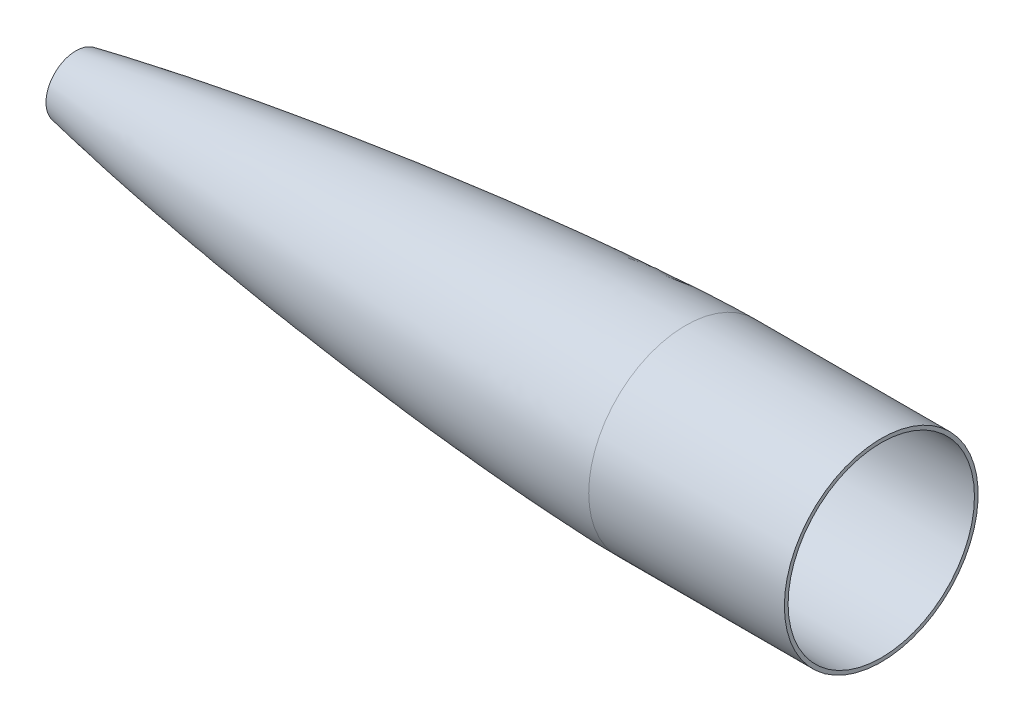
ISO-10303-21;
HEADER;
FILE_DESCRIPTION(('STEP AP214'),'2;1');
FILE_NAME('part.step','',(''),(''),'','','');
FILE_SCHEMA(('AUTOMOTIVE_DESIGN { 1 0 10303 214 1 1 1 1 }'));
ENDSEC;
DATA;
#1=APPLICATION_CONTEXT('core data for automotive mechanical design processes');
#2=APPLICATION_PROTOCOL_DEFINITION('international standard','automotive_design',2000,#1);
#3=PRODUCT_CONTEXT('',#1,'mechanical');
#4=PRODUCT('Part','Part','',(#3));
#5=PRODUCT_RELATED_PRODUCT_CATEGORY('part','',(#4));
#6=PRODUCT_DEFINITION_FORMATION('','',#4);
#7=PRODUCT_DEFINITION_CONTEXT('part definition',#1,'design');
#8=PRODUCT_DEFINITION('design','',#6,#7);
#9=PRODUCT_DEFINITION_SHAPE('','',#8);
#10=(LENGTH_UNIT() NAMED_UNIT(*) SI_UNIT(.MILLI.,.METRE.));
#11=(NAMED_UNIT(*) PLANE_ANGLE_UNIT() SI_UNIT($,.RADIAN.));
#12=(NAMED_UNIT(*) SI_UNIT($,.STERADIAN.) SOLID_ANGLE_UNIT());
#13=UNCERTAINTY_MEASURE_WITH_UNIT(LENGTH_MEASURE(1.E-05),#10,'distance_accuracy_value','');
#14=(GEOMETRIC_REPRESENTATION_CONTEXT(3) GLOBAL_UNCERTAINTY_ASSIGNED_CONTEXT((#13)) GLOBAL_UNIT_ASSIGNED_CONTEXT((#10,
#11,#12)) REPRESENTATION_CONTEXT('',''));
#15=CARTESIAN_POINT('',(0.,0.,0.));
#16=DIRECTION('',(0.,0.,1.));
#17=DIRECTION('',(1.,0.,0.));
#18=AXIS2_PLACEMENT_3D('',#15,#16,#17);
#19=CARTESIAN_POINT('',(-19.05,0.,0.));
#20=DIRECTION('',(-1.,0.,0.));
#21=DIRECTION('',(0.,0.,1.));
#22=AXIS2_PLACEMENT_3D('',#19,#20,#21);
#23=CYLINDRICAL_SURFACE('',#22,39.7256);
#24=CARTESIAN_POINT('',(294.4368,0.,0.));
#25=DIRECTION('',(-1.,0.,0.));
#26=DIRECTION('',(0.,0.,1.));
#27=AXIS2_PLACEMENT_3D('',#24,#25,#26);
#28=CIRCLE('',#27,39.7256);
#29=CARTESIAN_POINT('',(294.4368,0.,39.7256));
#30=VERTEX_POINT('',#29);
#31=EDGE_CURVE('E10',#30,#30,#28,.T.);
#32=ORIENTED_EDGE('',*,*,#31,.F.);
#33=EDGE_LOOP('',(#32));
#34=FACE_BOUND('',#33,.T.);
#35=CARTESIAN_POINT('',(374.650064344496,0.,0.));
#36=DIRECTION('',(-1.,0.,0.));
#37=DIRECTION('',(0.,0.,1.));
#38=AXIS2_PLACEMENT_3D('',#35,#36,#37);
#39=CIRCLE('',#38,39.7256);
#40=CARTESIAN_POINT('',(374.650064344496,0.,39.7256));
#41=VERTEX_POINT('',#40);
#42=EDGE_CURVE('E37',#41,#41,#39,.T.);
#43=ORIENTED_EDGE('',*,*,#42,.T.);
#44=EDGE_LOOP('',(#43));
#45=FACE_BOUND('',#44,.T.);
#46=ADVANCED_FACE('F30',(#34,#45),#23,.T.);
#47=CARTESIAN_POINT('',(294.4368,39.7256,0.));
#48=CARTESIAN_POINT('',(293.538264936894,39.7227781703544,0.));
#49=CARTESIAN_POINT('',(291.741303803302,39.7002039400171,0.));
#50=CARTESIAN_POINT('',(288.147806256193,39.6307016879067,0.));
#51=CARTESIAN_POINT('',(279.918815613173,39.3889822589623,0.));
#52=CARTESIAN_POINT('',(267.957235485054,38.8762226570791,0.));
#53=CARTESIAN_POINT('',(252.269921818901,37.9897310289716,0.));
#54=CARTESIAN_POINT('',(233.761451080803,36.6987300745286,0.));
#55=CARTESIAN_POINT('',(215.268686952188,35.200969595861,0.));
#56=CARTESIAN_POINT('',(196.792047007808,33.5162401971686,0.));
#57=CARTESIAN_POINT('',(178.332324198228,31.6557055301637,0.));
#58=CARTESIAN_POINT('',(159.890639304378,29.6240021598707,0.));
#59=CARTESIAN_POINT('',(141.468704528161,27.4205610926059,0.));
#60=CARTESIAN_POINT('',(123.068739671915,25.0400732746453,0.));
#61=CARTESIAN_POINT('',(104.694212708318,22.4706963349108,0.));
#62=CARTESIAN_POINT('',(86.3496826980187,19.6939502091708,0.));
#63=CARTESIAN_POINT('',(68.0430622365847,16.6772648540575,0.));
#64=CARTESIAN_POINT('',(49.818424698582,13.3765223021058,0.));
#65=CARTESIAN_POINT('',(33.9406856398122,10.1498634465492,0.));
#66=CARTESIAN_POINT('',(21.1447927754208,7.19091792425048,0.));
#67=CARTESIAN_POINT('',(12.0854389700209,4.74376046507185,0.));
#68=CARTESIAN_POINT('',(7.05576322628537,3.17959978307188,0.));
#69=CARTESIAN_POINT('',(4.0188012304067,2.08676764385367,0.));
#70=CARTESIAN_POINT('',(2.33371074508546,1.38731323839093,0.));
#71=CARTESIAN_POINT('',(1.40388432372297,0.947026682290267,0.));
#72=CARTESIAN_POINT('',(0.87209723308368,0.661946371557733,0.));
#73=CARTESIAN_POINT('',(0.556889445492457,0.472533954344698,0.));
#74=CARTESIAN_POINT('',(0.370605462423568,0.347964982562249,0.));
#75=CARTESIAN_POINT('',(0.248450567810074,0.257670761882754,0.));
#76=CARTESIAN_POINT('',(0.159992101765354,0.185526094257961,0.));
#77=CARTESIAN_POINT('',(0.0986367195289148,0.129934350685668,0.));
#78=CARTESIAN_POINT('',(0.0520006916757201,0.0813137653612726,0.));
#79=CARTESIAN_POINT('',(0.0201829235935841,0.0404052506099982,0.));
#80=CARTESIAN_POINT('',(0.00657570245071043,0.0182498433560136,0.));
#81=CARTESIAN_POINT('',(0.00185773297492475,0.0062340322543729,0.));
#82=CARTESIAN_POINT('',(0.,0.,0.));
#83=B_SPLINE_CURVE_WITH_KNOTS('',4,(#47,#48,#49,#50,#51,#52,#53,#54,#55,#56,#57,#58,#59,#60,#61,
#62,#63,#64,#65,#66,#67,#68,#69,#70,#71,#72,#73,#74,#75,#76,#77,#78,#79,#80,#81,#82),
.UNSPECIFIED.,.F.,.F.,(5,1,1,1,1,1,1,1,1,1,1,1,1,1,1,1,1,1,1,1,1,1,1,1,1,1,1,1,1,1,1,1,5),(0.,
0.0120599701125952,0.0241199402251903,0.0482398804503805,0.1104935820596,0.172747283844769,
0.235000984013769,0.297254686823773,0.359508386221387,0.421762088339113,0.484015788959948,
0.546269489090148,0.60852319021114,0.670776891466794,0.733030591698496,0.795284289783134,
0.857537990172938,0.919348906793277,0.95047573101264,0.971525230460581,0.983463902787434,
0.99002606304966,0.993781479893161,0.996003962640871,0.997267165840399,0.998121150964244,
0.998715599634537,0.999010469110389,0.999305338586241,0.99965266929312,0.99982633464656,
0.99991316732328,1.),.UNSPECIFIED.);
#84=CARTESIAN_POINT('',(-19.05,0.,0.));
#85=DIRECTION('',(-1.,0.,0.));
#86=AXIS1_PLACEMENT('',#84,#85);
#87=SURFACE_OF_REVOLUTION('',#83,#86);
#88=CARTESIAN_POINT('',(44.4500643444959,0.,0.));
#89=DIRECTION('',(-1.,0.,0.));
#90=DIRECTION('',(0.,0.,1.));
#91=AXIS2_PLACEMENT_3D('',#88,#89,#90);
#92=CIRCLE('',#91,12.2403045277828);
#93=CARTESIAN_POINT('',(44.4500643444959,0.,12.2403045277828));
#94=VERTEX_POINT('',#93);
#95=EDGE_CURVE('E149',#94,#94,#92,.F.);
#96=ORIENTED_EDGE('',*,*,#95,.T.);
#97=EDGE_LOOP('',(#96));
#98=FACE_BOUND('',#97,.T.);
#99=ORIENTED_EDGE('',*,*,#31,.T.);
#100=EDGE_LOOP('',(#99));
#101=FACE_BOUND('',#100,.T.);
#102=ADVANCED_FACE('F53',(#98,#101),#87,.T.);
#103=CARTESIAN_POINT('',(374.650064344496,0.,0.));
#104=DIRECTION('',(-1.,0.,0.));
#105=DIRECTION('',(0.,0.,1.));
#106=AXIS2_PLACEMENT_3D('',#103,#104,#105);
#107=PLANE('',#106);
#108=CARTESIAN_POINT('',(374.650064344496,0.,0.));
#109=DIRECTION('',(-1.,0.,0.));
#110=DIRECTION('',(0.,0.,1.));
#111=AXIS2_PLACEMENT_3D('',#108,#109,#110);
#112=CIRCLE('',#111,38.2016);
#113=CARTESIAN_POINT('',(374.650064344496,0.,38.2016));
#114=VERTEX_POINT('',#113);
#115=EDGE_CURVE('E48',#114,#114,#112,.T.);
#116=ORIENTED_EDGE('',*,*,#115,.T.);
#117=EDGE_LOOP('',(#116));
#118=FACE_BOUND('',#117,.T.);
#119=ORIENTED_EDGE('',*,*,#42,.F.);
#120=EDGE_LOOP('',(#119));
#121=FACE_BOUND('',#120,.T.);
#122=ADVANCED_FACE('F56',(#118,#121),#107,.F.);
#123=CARTESIAN_POINT('',(-19.05,0.,0.));
#124=DIRECTION('',(-1.,0.,0.));
#125=DIRECTION('',(0.,0.,1.));
#126=AXIS2_PLACEMENT_3D('',#123,#124,#125);
#127=CYLINDRICAL_SURFACE('',#126,38.2016);
#128=CARTESIAN_POINT('',(294.441586064899,0.,38.2016075152473));
#129=CARTESIAN_POINT('',(294.441586064891,-0.625072972520353,38.2016207745964));
#130=CARTESIAN_POINT('',(294.441586064892,-1.25014481680002,38.1862664038765));
#131=CARTESIAN_POINT('',(294.441586064899,-2.49878325596288,38.1249176080443));
#132=CARTESIAN_POINT('',(294.441586064904,-3.12234985084618,38.0789231829345));
#133=CARTESIAN_POINT('',(294.441586064905,-4.36647479842312,37.9563894840658));
#134=CARTESIAN_POINT('',(294.441586064901,-4.98703315111663,37.8798502103057));
#135=CARTESIAN_POINT('',(294.441586064898,-6.22364684018645,37.6964153836531));
#136=CARTESIAN_POINT('',(294.4415860649,-6.83970217656285,37.5895198307611));
#137=CARTESIAN_POINT('',(294.441586064906,-8.06582564670876,37.3456288466498));
#138=CARTESIAN_POINT('',(294.44158606491,-8.67589378047843,37.2086334154311));
#139=CARTESIAN_POINT('',(294.441586064911,-9.88857315263689,36.9048730087374));
#140=CARTESIAN_POINT('',(294.441586064908,-10.4911843910252,36.7381080332605));
#141=CARTESIAN_POINT('',(294.441586064903,-11.6874982251756,36.3752102090804));
#142=CARTESIAN_POINT('',(294.441586064901,-12.2812008209376,36.1790773603773));
#143=CARTESIAN_POINT('',(294.44158606489,-13.4582670893082,35.7579163125127));
#144=CARTESIAN_POINT('',(294.441586064881,-14.0416307619172,35.5328881133528));
#145=CARTESIAN_POINT('',(294.441586064886,-15.1966138095815,35.0544784714208));
#146=CARTESIAN_POINT('',(294.441586064899,-15.7682331846361,34.801097028647));
#147=CARTESIAN_POINT('',(294.44158606491,-16.8983505561088,34.2665913191246));
#148=CARTESIAN_POINT('',(294.441586064906,-17.4568485525265,33.9854670523749));
#149=CARTESIAN_POINT('',(294.441586064901,-18.559377696023,33.3961529475129));
#150=CARTESIAN_POINT('',(294.4415860649,-19.1034088431036,33.0879631094038));
#151=CARTESIAN_POINT('',(294.441586064901,-20.1756936693301,32.4452603182113));
#152=CARTESIAN_POINT('',(294.441586064904,-20.7039473484756,32.1107473651272));
#153=CARTESIAN_POINT('',(294.441586064905,-21.7434046294472,31.4162042149567));
#154=CARTESIAN_POINT('',(294.441586064904,-22.2546082312729,31.0561740178697));
#155=CARTESIAN_POINT('',(294.441586064905,-23.2587338233481,30.3114637239814));
#156=CARTESIAN_POINT('',(294.441586064907,-23.7516558135973,29.9267836271797));
#157=CARTESIAN_POINT('',(294.441586064905,-24.7180306902463,29.1337002619244));
#158=CARTESIAN_POINT('',(294.441586064902,-25.1914835766467,28.7252969934715));
#159=CARTESIAN_POINT('',(294.4415860649,-26.1177796561554,27.8857511641365));
#160=CARTESIAN_POINT('',(294.441586064901,-26.5706228492631,27.4546086032536));
#161=CARTESIAN_POINT('',(294.441586064902,-27.4546086032431,26.5706228492736));
#162=CARTESIAN_POINT('',(294.441586064904,-27.885751164116,26.117779656177));
#163=CARTESIAN_POINT('',(294.4415860649,-28.725296993452,25.1914835766693));
#164=CARTESIAN_POINT('',(294.441586064895,-29.1337002619148,24.7180306902578));
#165=CARTESIAN_POINT('',(294.441586064892,-29.9267836271488,23.751655813635));
#166=CARTESIAN_POINT('',(294.441586064893,-30.3114637239217,23.2587338234251));
#167=CARTESIAN_POINT('',(294.441586064897,-31.0561740178129,22.2546082313528));
#168=CARTESIAN_POINT('',(294.441586064899,-31.4162042149278,21.7434046294877));
#169=CARTESIAN_POINT('',(294.4415860649,-32.1107473651354,20.7039473484662));
#170=CARTESIAN_POINT('',(294.441586064898,-32.4452603182303,20.1756936693111));
#171=CARTESIAN_POINT('',(294.441586064894,-33.0879631094284,19.1034088430499));
#172=CARTESIAN_POINT('',(294.44158606489,-33.3961529475315,18.5593776959436));
#173=CARTESIAN_POINT('',(294.441586064886,-33.9854670524354,17.4568485524578));
#174=CARTESIAN_POINT('',(294.441586064885,-34.2665913192357,16.8983505560781));
#175=CARTESIAN_POINT('',(294.441586064892,-34.801097028535,15.7682331846684));
#176=CARTESIAN_POINT('',(294.441586064901,-35.0544784710353,15.1966138096391));
#177=CARTESIAN_POINT('',(294.441586064902,-35.5328881136757,14.041630762011));
#178=CARTESIAN_POINT('',(294.441586064895,-35.7579163138138,13.4582670894113));
#179=CARTESIAN_POINT('',(294.441586064897,-36.1790773590613,12.281200820876));
#180=CARTESIAN_POINT('',(294.441586064906,-36.3752102041712,11.6874982249406));
#181=CARTESIAN_POINT('',(294.441586064905,-36.7381080381535,10.4911843913137));
#182=CARTESIAN_POINT('',(294.441586064894,-36.9048730270277,9.88857315362268));
#183=CARTESIAN_POINT('',(294.441586064893,-37.2086333970878,8.67589377970386));
#184=CARTESIAN_POINT('',(294.441586064902,-37.3456287782738,8.06582564347604));
#185=CARTESIAN_POINT('',(294.441586064905,-37.5895198990956,6.83970218000428));
#186=CARTESIAN_POINT('',(294.441586064899,-37.6964156387287,6.22364685275981));
#187=CARTESIAN_POINT('',(294.441586064899,-37.8798499552237,4.98703313858579));
#188=CARTESIAN_POINT('',(294.441586064905,-37.9563885320872,4.36647475165647));
#189=CARTESIAN_POINT('',(294.441586064904,-38.0789241349129,3.12234989761487));
#190=CARTESIAN_POINT('',(294.441586064896,-38.1249211608762,2.49878343050271));
#191=CARTESIAN_POINT('',(294.441586064894,-38.1862628510446,1.25014464226043));
#192=CARTESIAN_POINT('',(294.441586064899,-38.2016075152473,0.625072321130206));
#193=CARTESIAN_POINT('',(294.441586064899,-38.2016075152473,-0.625072321130239));
#194=CARTESIAN_POINT('',(294.441586064894,-38.1862628510446,-1.25014464226046));
#195=CARTESIAN_POINT('',(294.441586064896,-38.1249211608762,-2.49878343050245));
#196=CARTESIAN_POINT('',(294.441586064904,-38.0789241349129,-3.12234989761433));
#197=CARTESIAN_POINT('',(294.441586064905,-37.9563885320831,-4.36647475169881));
#198=CARTESIAN_POINT('',(294.4415860649,-37.8798499552132,-4.98703313867107));
#199=CARTESIAN_POINT('',(294.441586064899,-37.6964156387202,-6.22364685280276));
#200=CARTESIAN_POINT('',(294.441586064903,-37.5895198991017,-6.83970217996289));
#201=CARTESIAN_POINT('',(294.441586064903,-37.3456287782929,-8.06582564339056));
#202=CARTESIAN_POINT('',(294.441586064897,-37.2086333970993,-8.67589377965746));
#203=CARTESIAN_POINT('',(294.44158606489,-36.9048730270299,-9.88857315361437));
#204=CARTESIAN_POINT('',(294.441586064888,-36.738108038156,-10.4911843913049));
#205=CARTESIAN_POINT('',(294.441586064889,-36.3752102041621,-11.6874982249709));
#206=CARTESIAN_POINT('',(294.441586064893,-36.1790773590385,-12.2812008209453));
#207=CARTESIAN_POINT('',(294.441586064898,-35.7579163138017,-13.4582670894398));
#208=CARTESIAN_POINT('',(294.441586064899,-35.5328881136937,-14.0416307619617));
#209=CARTESIAN_POINT('',(294.441586064901,-35.0544784710683,-15.1966138095652));
#210=CARTESIAN_POINT('',(294.441586064904,-34.8010970285467,-15.7682331846449));
#211=CARTESIAN_POINT('',(294.441586064905,-34.2665913192104,-16.8983505561304));
#212=CARTESIAN_POINT('',(294.441586064905,-33.9854670523958,-17.4568485525361));
#213=CARTESIAN_POINT('',(294.441586064902,-33.396152947493,-18.5593776960117));
#214=CARTESIAN_POINT('',(294.4415860649,-33.0879631094083,-19.1034088430834));
#215=CARTESIAN_POINT('',(294.441586064901,-32.4452603182429,-20.1756936692901));
#216=CARTESIAN_POINT('',(294.441586064903,-32.1107473651617,-20.7039473484247));
#217=CARTESIAN_POINT('',(294.441586064905,-31.4162042149759,-21.7434046294179));
#218=CARTESIAN_POINT('',(294.441586064905,-31.0561740178686,-22.2546082312748));
#219=CARTESIAN_POINT('',(294.441586064904,-30.3114637239656,-23.258733823369));
#220=CARTESIAN_POINT('',(294.441586064903,-29.9267836271714,-23.7516558136075));
#221=CARTESIAN_POINT('',(294.441586064898,-29.1337002619148,-24.7180306902578));
#222=CARTESIAN_POINT('',(294.441586064894,-28.725296993452,-25.1914835766693));
#223=CARTESIAN_POINT('',(294.441586064896,-27.8857511641265,-26.1177796561654));
#224=CARTESIAN_POINT('',(294.441586064902,-27.4546086032647,-26.5706228492509));
#225=CARTESIAN_POINT('',(294.441586064901,-26.5706228492858,-27.454608603232));
#226=CARTESIAN_POINT('',(294.441586064895,-26.117779656167,-27.885751164126));
#227=CARTESIAN_POINT('',(294.441586064895,-25.1914835766467,-28.7252969934715));
#228=CARTESIAN_POINT('',(294.441586064902,-24.7180306902463,-29.1337002619243));
#229=CARTESIAN_POINT('',(294.441586064899,-23.7516558136248,-29.9267836271572));
#230=CARTESIAN_POINT('',(294.441586064891,-23.2587338234043,-30.311463723938));
#231=CARTESIAN_POINT('',(294.441586064889,-22.2546082313311,-31.0561740178281));
#232=CARTESIAN_POINT('',(294.441586064896,-21.7434046294767,-31.4162042149351));
#233=CARTESIAN_POINT('',(294.441586064902,-20.7039473484662,-32.1107473651354));
#234=CARTESIAN_POINT('',(294.4415860649,-20.1756936693111,-32.4452603182303));
#235=CARTESIAN_POINT('',(294.441586064892,-19.1034088430499,-33.0879631094284));
#236=CARTESIAN_POINT('',(294.441586064885,-18.5593776959436,-33.3961529475315));
#237=CARTESIAN_POINT('',(294.44158606489,-17.4568485524662,-33.9854670524309));
#238=CARTESIAN_POINT('',(294.441586064902,-16.898350556095,-34.2665913192272));
#239=CARTESIAN_POINT('',(294.441586064907,-15.7682331846845,-34.801097028528));
#240=CARTESIAN_POINT('',(294.441586064899,-15.1966138096452,-35.0544784710328));
#241=CARTESIAN_POINT('',(294.441586064901,-14.0416307620475,-35.5328881136604));
#242=CARTESIAN_POINT('',(294.441586064911,-13.4582670894892,-35.7579163137838));
#243=CARTESIAN_POINT('',(294.441586064914,-12.2812008209633,-36.1790773590324));
#244=CARTESIAN_POINT('',(294.441586064907,-11.6874982249946,-36.3752102041545));
#245=CARTESIAN_POINT('',(294.441586064904,-10.491184391304,-36.7381080381568));
#246=CARTESIAN_POINT('',(294.441586064909,-9.88857315358276,-36.904873027039));
#247=CARTESIAN_POINT('',(294.44158606491,-8.67589377959438,-37.2086333971141));
#248=CARTESIAN_POINT('',(294.441586064907,-8.06582564332716,-37.3456287783066));
#249=CARTESIAN_POINT('',(294.4415860649,-6.83970217986199,-37.5895198991207));
#250=CARTESIAN_POINT('',(294.441586064898,-6.22364685266433,-37.6964156387437));
#251=CARTESIAN_POINT('',(294.4415860649,-4.98703313854245,-37.8798499552293));
#252=CARTESIAN_POINT('',(294.441586064905,-4.36647475161817,-37.9563885320916));
#253=CARTESIAN_POINT('',(294.441586064903,-3.12234989758717,-38.078924134915));
#254=CARTESIAN_POINT('',(294.441586064896,-2.49878343048059,-38.1249211608776));
#255=CARTESIAN_POINT('',(294.441586064894,-1.25014464224941,-38.1862628510449));
#256=CARTESIAN_POINT('',(294.441586064899,-0.625072321124702,-38.2016075152473));
#257=CARTESIAN_POINT('',(294.441586064899,0.625072321124707,-38.2016075152473));
#258=CARTESIAN_POINT('',(294.441586064894,1.25014464224941,-38.1862628510449));
#259=CARTESIAN_POINT('',(294.441586064896,2.49878343052469,-38.1249211608754));
#260=CARTESIAN_POINT('',(294.441586064903,3.12234989767528,-38.0789241349085));
#261=CARTESIAN_POINT('',(294.441586064905,4.36647475170504,-37.9563885320808));
#262=CARTESIAN_POINT('',(294.441586064901,4.98703313858451,-37.8798499552231));
#263=CARTESIAN_POINT('',(294.441586064898,6.22364685266272,-37.696415638744));
#264=CARTESIAN_POINT('',(294.4415860649,6.83970217986118,-37.5895198991208));
#265=CARTESIAN_POINT('',(294.441586064906,8.06582564336673,-37.3456287782987));
#266=CARTESIAN_POINT('',(294.441586064911,8.67589377967314,-37.2086333970964));
#267=CARTESIAN_POINT('',(294.44158606491,9.88857315365743,-36.9048730270182));
#268=CARTESIAN_POINT('',(294.441586064904,10.4911843913364,-36.7381080381468));
#269=CARTESIAN_POINT('',(294.441586064907,11.6874982249485,-36.3752102041686));
#270=CARTESIAN_POINT('',(294.441586064916,12.2812008208809,-36.1790773590597));
#271=CARTESIAN_POINT('',(294.441586064909,13.4582670894112,-35.7579163138139));
#272=CARTESIAN_POINT('',(294.441586064892,14.0416307620089,-35.5328881136764));
#273=CARTESIAN_POINT('',(294.441586064879,15.1966138096385,-35.0544784710356));
#274=CARTESIAN_POINT('',(294.441586064882,15.7682331846711,-34.8010970285339));
#275=CARTESIAN_POINT('',(294.441586064895,16.89835055607,-34.2665913192394));
#276=CARTESIAN_POINT('',(294.441586064903,17.4568485524362,-33.9854670524463));
#277=CARTESIAN_POINT('',(294.441586064904,18.5593776959376,-33.3961529475356));
#278=CARTESIAN_POINT('',(294.441586064896,19.1034088430718,-33.0879631094163));
#279=CARTESIAN_POINT('',(294.441586064896,20.1756936693328,-32.4452603182161));
#280=CARTESIAN_POINT('',(294.441586064904,20.7039473484612,-32.110747365138));
#281=CARTESIAN_POINT('',(294.441586064904,21.7434046294236,-31.4162042149714));
#282=CARTESIAN_POINT('',(294.441586064897,22.2546082312564,-31.0561740178812));
#283=CARTESIAN_POINT('',(294.441586064894,23.258733823333,-30.3114637239933));
#284=CARTESIAN_POINT('',(294.441586064899,23.7516558135768,-29.9267836271959));
#285=CARTESIAN_POINT('',(294.441586064902,24.7180306902308,-29.1337002619377));
#286=CARTESIAN_POINT('',(294.441586064901,25.1914835766409,-28.7252969934769));
#287=CARTESIAN_POINT('',(294.441586064902,26.117779656146,-27.8857511641449));
#288=CARTESIAN_POINT('',(294.441586064903,26.5706228492414,-27.4546086032742));
#289=CARTESIAN_POINT('',(294.4415860649,27.4546086032309,-26.5706228492869));
#290=CARTESIAN_POINT('',(294.441586064895,27.8857511641238,-26.1177796561693));
#291=CARTESIAN_POINT('',(294.441586064895,28.7252969934768,-25.1914835766409));
#292=CARTESIAN_POINT('',(294.441586064901,29.1337002619377,-24.7180306902308));
#293=CARTESIAN_POINT('',(294.4415860649,29.9267836271875,-23.751655813587));
#294=CARTESIAN_POINT('',(294.441586064894,30.3114637239771,-23.2587338233538));
#295=CARTESIAN_POINT('',(294.441586064896,31.056174017844,-22.2546082313076));
#296=CARTESIAN_POINT('',(294.441586064904,31.4162042149215,-21.7434046294949));
#297=CARTESIAN_POINT('',(294.441586064904,32.1107473651006,-20.7039473485204));
#298=CARTESIAN_POINT('',(294.441586064896,32.4452603182013,-20.175693669358));
#299=CARTESIAN_POINT('',(294.441586064896,33.0879631094147,-19.1034088430741));
#300=CARTESIAN_POINT('',(294.441586064905,33.3961529475271,-18.5593776959524));
#301=CARTESIAN_POINT('',(294.441586064902,33.9854670524324,-17.4568485524633));
#302=CARTESIAN_POINT('',(294.44158606489,34.2665913192263,-16.8983505560964));
#303=CARTESIAN_POINT('',(294.441586064887,34.8010970285401,-15.7682331846591));
#304=CARTESIAN_POINT('',(294.441586064895,35.0544784710583,-15.1966138095878));
#305=CARTESIAN_POINT('',(294.441586064908,35.5328881136956,-14.0416307619586));
#306=CARTESIAN_POINT('',(294.441586064912,35.7579163138168,-13.4582670894015));
#307=CARTESIAN_POINT('',(294.441586064913,36.1790773590637,-12.2812008208713));
#308=CARTESIAN_POINT('',(294.441586064911,36.375210204186,-11.6874982248969));
#309=CARTESIAN_POINT('',(294.4415860649,36.7381080381745,-10.4911843912398));
#310=CARTESIAN_POINT('',(294.441586064892,36.9048730270448,-9.88857315355823));
#311=CARTESIAN_POINT('',(294.441586064893,37.2086333971101,-8.67589377961121));
#312=CARTESIAN_POINT('',(294.441586064901,37.3456287783027,-8.06582564334513));
#313=CARTESIAN_POINT('',(294.441586064905,37.5895198991173,-6.83970217988037));
#314=CARTESIAN_POINT('',(294.441586064899,37.6964156387408,-6.22364685268197));
#315=CARTESIAN_POINT('',(294.4415860649,37.8798499552208,-4.98703313860173));
#316=CARTESIAN_POINT('',(294.441586064905,37.9563885320791,-4.36647475172013));
#317=CARTESIAN_POINT('',(294.441586064904,38.0789241349077,-3.12234989768589));
#318=CARTESIAN_POINT('',(294.441586064896,38.1249211608749,-2.49878343053296));
#319=CARTESIAN_POINT('',(294.441586064894,38.1862628510448,-1.25014464225335));
#320=CARTESIAN_POINT('',(294.441586064899,38.2016075152473,-0.625072321126677));
#321=CARTESIAN_POINT('',(294.441586064899,38.2016075152473,0.625072321126677));
#322=CARTESIAN_POINT('',(294.441586064894,38.1862628510448,1.25014464225336));
#323=CARTESIAN_POINT('',(294.441586064896,38.1249211608771,2.49878343048861));
#324=CARTESIAN_POINT('',(294.441586064904,38.0789241349142,3.1223498975973));
#325=CARTESIAN_POINT('',(294.441586064905,37.95638853209,4.36647475163196));
#326=CARTESIAN_POINT('',(294.4415860649,37.8798499552273,4.98703313855781));
#327=CARTESIAN_POINT('',(294.441586064899,37.6964156387408,6.22364685268198));
#328=CARTESIAN_POINT('',(294.441586064904,37.5895198991173,6.83970217988037));
#329=CARTESIAN_POINT('',(294.441586064902,37.3456287783022,8.06582564334775));
#330=CARTESIAN_POINT('',(294.441586064894,37.2086333971089,8.67589377961642));
#331=CARTESIAN_POINT('',(294.441586064893,36.9048730270323,9.88857315360768));
#332=CARTESIAN_POINT('',(294.4415860649,36.7381080381493,10.4911843913304));
#333=CARTESIAN_POINT('',(294.44158606491,36.3752102041573,11.6874982249837));
#334=CARTESIAN_POINT('',(294.441586064913,36.1790773590483,12.2812008209144));
#335=CARTESIAN_POINT('',(294.441586064912,35.7579163138167,13.4582670894016));
#336=CARTESIAN_POINT('',(294.441586064908,35.5328881136956,14.0416307619586));
#337=CARTESIAN_POINT('',(294.441586064895,35.0544784710583,15.1966138095878));
#338=CARTESIAN_POINT('',(294.441586064887,34.8010970285401,15.7682331846591));
#339=CARTESIAN_POINT('',(294.44158606489,34.2665913192263,16.8983505560964));
#340=CARTESIAN_POINT('',(294.441586064902,33.9854670524324,17.4568485524633));
#341=CARTESIAN_POINT('',(294.441586064905,33.3961529475271,18.5593776959524));
#342=CARTESIAN_POINT('',(294.441586064896,33.0879631094147,19.1034088430741));
#343=CARTESIAN_POINT('',(294.441586064896,32.4452603182013,20.175693669358));
#344=CARTESIAN_POINT('',(294.441586064906,32.1107473651006,20.7039473485204));
#345=CARTESIAN_POINT('',(294.441586064903,31.4162042149413,21.7434046294653));
#346=CARTESIAN_POINT('',(294.44158606489,31.056174017885,22.2546082312494));
#347=CARTESIAN_POINT('',(294.44158606489,30.3114637240209,23.2587338232976));
#348=CARTESIAN_POINT('',(294.441586064902,29.9267836272101,23.7516558135595));
#349=CARTESIAN_POINT('',(294.44158606491,29.1337002619367,24.718030690232));
#350=CARTESIAN_POINT('',(294.441586064906,28.7252969934749,25.1914835766432));
#351=CARTESIAN_POINT('',(294.441586064897,27.8857511641323,26.1177796561599));
#352=CARTESIAN_POINT('',(294.441586064893,27.4546086032514,26.5706228492652));
#353=CARTESIAN_POINT('',(294.441586064897,26.5706228492758,27.4546086032409));
#354=CARTESIAN_POINT('',(294.441586064906,26.1177796561815,27.8857511641117));
#355=CARTESIAN_POINT('',(294.441586064909,25.1914835766658,28.7252969934554));
#356=CARTESIAN_POINT('',(294.441586064905,24.7180306902436,29.1337002619273));
#357=CARTESIAN_POINT('',(294.441586064896,23.7516558135973,29.926783627179));
#358=CARTESIAN_POINT('',(294.441586064893,23.2587338233746,30.3114637239603));
#359=CARTESIAN_POINT('',(294.441586064897,22.2546082312996,31.0561740178512));
#360=CARTESIAN_POINT('',(294.441586064904,21.7434046294456,31.4162042149585));
#361=CARTESIAN_POINT('',(294.441586064904,20.7039473484611,32.1107473651362));
#362=CARTESIAN_POINT('',(294.441586064896,20.1756936693325,32.4452603182094));
#363=CARTESIAN_POINT('',(294.441586064896,19.1034088430722,33.0879631094231));
#364=CARTESIAN_POINT('',(294.441586064904,18.5593776959388,33.3961529475609));
#365=CARTESIAN_POINT('',(294.441586064903,17.456848552435,33.985467052421));
#366=CARTESIAN_POINT('',(294.441586064893,16.8983505560654,34.2665913191449));
#367=CARTESIAN_POINT('',(294.441586064892,15.7682331846834,34.8010970286247));
#368=CARTESIAN_POINT('',(294.441586064901,15.1966138096713,35.0544784713811));
#369=CARTESIAN_POINT('',(294.441586064902,14.0416307620108,35.5328881133166));
#370=CARTESIAN_POINT('',(294.441586064895,13.4582670893615,35.7579163124934));
#371=CARTESIAN_POINT('',(294.441586064897,12.2812008209586,36.17907736037));
#372=CARTESIAN_POINT('',(294.441586064906,11.6874982252054,36.3752102090707));
#373=CARTESIAN_POINT('',(294.441586064905,10.4911843910666,36.7381080332487));
#374=CARTESIAN_POINT('',(294.441586064894,9.88857315268098,36.9048730087255));
#375=CARTESIAN_POINT('',(294.441586064893,8.67589378048886,37.2086334154293));
#376=CARTESIAN_POINT('',(294.441586064901,8.06582564668234,37.3456288466561));
#377=CARTESIAN_POINT('',(294.441586064905,6.83970217654654,37.5895198307633));
#378=CARTESIAN_POINT('',(294.441586064899,6.22364684021794,37.6964153836471));
#379=CARTESIAN_POINT('',(294.441586064899,4.98703315120306,37.8798502102942));
#380=CARTESIAN_POINT('',(294.441586064905,4.36647479851641,37.956389484055));
#381=CARTESIAN_POINT('',(294.441586064904,3.12234985090755,38.0789231829301));
#382=CARTESIAN_POINT('',(294.441586064899,2.49878325598524,38.1249176080435));
#383=CARTESIAN_POINT('',(294.441586064892,1.25014481678885,38.1862664038767));
#384=CARTESIAN_POINT('',(294.441586064891,0.625072972514758,38.2016207745964));
#385=CARTESIAN_POINT('',(294.441586064899,0.,38.2016075152473));
#386=B_SPLINE_CURVE_WITH_KNOTS('',3,(#128,#129,#130,#131,#132,#133,#134,#135,#136,#137,#138,
#139,#140,#141,#142,#143,#144,#145,#146,#147,#148,#149,#150,#151,#152,#153,#154,#155,#156,#157,
#158,#159,#160,#161,#162,#163,#164,#165,#166,#167,#168,#169,#170,#171,#172,#173,#174,#175,#176,
#177,#178,#179,#180,#181,#182,#183,#184,#185,#186,#187,#188,#189,#190,#191,#192,#193,#194,#195,
#196,#197,#198,#199,#200,#201,#202,#203,#204,#205,#206,#207,#208,#209,#210,#211,#212,#213,#214,
#215,#216,#217,#218,#219,#220,#221,#222,#223,#224,#225,#226,#227,#228,#229,#230,#231,#232,#233,
#234,#235,#236,#237,#238,#239,#240,#241,#242,#243,#244,#245,#246,#247,#248,#249,#250,#251,#252,
#253,#254,#255,#256,#257,#258,#259,#260,#261,#262,#263,#264,#265,#266,#267,#268,#269,#270,#271,
#272,#273,#274,#275,#276,#277,#278,#279,#280,#281,#282,#283,#284,#285,#286,#287,#288,#289,#290,
#291,#292,#293,#294,#295,#296,#297,#298,#299,#300,#301,#302,#303,#304,#305,#306,#307,#308,#309,
#310,#311,#312,#313,#314,#315,#316,#317,#318,#319,#320,#321,#322,#323,#324,#325,#326,#327,#328,
#329,#330,#331,#332,#333,#334,#335,#336,#337,#338,#339,#340,#341,#342,#343,#344,#345,#346,#347,
#348,#349,#350,#351,#352,#353,#354,#355,#356,#357,#358,#359,#360,#361,#362,#363,#364,#365,#366,
#367,#368,#369,#370,#371,#372,#373,#374,#375,#376,#377,#378,#379,#380,#381,#382,#383,#384,#385),
.UNSPECIFIED.,.F.,.F.,(4,2,2,2,2,2,2,2,2,2,2,2,2,2,2,2,2,2,2,2,2,2,2,2,2,2,2,2,2,2,2,2,2,2,2,2,
2,2,2,2,2,2,2,2,2,2,2,2,2,2,2,2,2,2,2,2,2,2,2,2,2,2,2,2,2,2,2,2,2,2,2,2,2,2,2,2,2,2,2,2,2,2,2,2,
2,2,2,2,2,2,2,2,2,2,2,2,2,2,2,2,2,2,2,2,2,2,2,2,2,2,2,2,2,2,2,2,2,2,2,2,2,2,2,2,2,2,2,2,4),(0.,
1.87502876001169,3.75005751988151,5.62508627983225,7.50011503975336,9.37514379962932,
11.2501725596238,13.125201319618,15.0002300795156,16.8752588395297,18.7502875996144,
20.625316359469,22.500345119366,24.3753738793071,26.2504026392807,28.1254313991993,
30.0004601591772,31.8754889191104,33.7505176790736,35.6255464389008,37.5005751989884,
39.3756039589196,41.2506327188573,43.1256614788246,45.0006902387158,46.8757189987364,
48.7507477587209,50.625776518596,52.5008052784737,54.3758340385221,56.2508627984713,
58.1258915583429,60.0009203183544,61.8759490783659,63.7509778382367,65.6260065983158,
67.5010353581078,69.3760641181047,71.2510928779782,73.1261216380864,75.0011503978572,
76.8761791579125,78.7512079179688,80.6262366777891,82.5012654376467,84.3762941977011,
86.2513229576352,88.1263517175983,90.0013804774845,91.8764092375095,93.751437997428,
95.6264667572948,97.5014955173428,99.376524277274,101.251553037212,103.126581797151,
105.001610557075,106.876639316963,108.751668077054,110.626696837023,112.50172559702,
114.376754356925,116.251783116859,118.126811876714,120.001840636709,121.876869396704,
123.751898156691,125.62692691649,127.501955676397,129.376984436515,131.252013196354,
133.127041956329,135.002070716343,136.877099476245,138.752128236166,140.627156996201,
142.502185756038,144.377214516004,146.252243275957,148.127272035913,150.002300795839,
151.877329555859,153.752358315815,155.627387075728,157.502415835623,159.377444595583,
161.252473355574,163.127502115498,165.002530875526,166.87755963541,168.752588395517,
170.627617155361,172.502645915355,174.377674675263,176.252703435068,178.127732195062,
180.002760955063,181.877789715064,183.752818474925,185.627847234864,187.502875994771,
189.377904754773,191.252933514747,193.127962274717,195.0029910346,196.878019794628,
198.753048554552,200.628077314544,202.503106074503,204.378134834291,206.253163594311,
208.128192354272,210.00322111424,211.878249874164,213.75327863417,215.628307394043,
217.503336154089,219.378364913925,221.25339367396,223.128422433881,225.003451193758,
226.878479953786,228.753508713753,230.62853747374,232.503566233729,234.378594993505,
236.253623753435,238.128652513423,240.003681273418),.UNSPECIFIED.);
#387=CARTESIAN_POINT('',(294.441586064899,0.,38.2016075152473));
#388=VERTEX_POINT('',#387);
#389=EDGE_CURVE('E41',#388,#388,#386,.F.);
#390=ORIENTED_EDGE('',*,*,#389,.T.);
#391=EDGE_LOOP('',(#390));
#392=FACE_BOUND('',#391,.T.);
#393=ORIENTED_EDGE('',*,*,#115,.F.);
#394=EDGE_LOOP('',(#393));
#395=FACE_BOUND('',#394,.T.);
#396=ADVANCED_FACE('F60',(#392,#395),#127,.F.);
#397=CARTESIAN_POINT('',(294.4368,39.7256,0.));
#398=CARTESIAN_POINT('',(293.538264936894,39.7227781703544,0.));
#399=CARTESIAN_POINT('',(291.741303803302,39.7002039400171,0.));
#400=CARTESIAN_POINT('',(288.147806256193,39.6307016879067,0.));
#401=CARTESIAN_POINT('',(279.918815613173,39.3889822589623,0.));
#402=CARTESIAN_POINT('',(267.957235485054,38.8762226570791,0.));
#403=CARTESIAN_POINT('',(252.269921818901,37.9897310289716,0.));
#404=CARTESIAN_POINT('',(233.761451080803,36.6987300745286,0.));
#405=CARTESIAN_POINT('',(215.268686952188,35.200969595861,0.));
#406=CARTESIAN_POINT('',(196.792047007808,33.5162401971686,0.));
#407=CARTESIAN_POINT('',(178.332324198228,31.6557055301637,0.));
#408=CARTESIAN_POINT('',(159.890639304378,29.6240021598707,0.));
#409=CARTESIAN_POINT('',(141.468704528161,27.4205610926059,0.));
#410=CARTESIAN_POINT('',(123.068739671915,25.0400732746453,0.));
#411=CARTESIAN_POINT('',(104.694212708318,22.4706963349108,0.));
#412=CARTESIAN_POINT('',(86.3496826980187,19.6939502091708,0.));
#413=CARTESIAN_POINT('',(68.0430622365847,16.6772648540575,0.));
#414=CARTESIAN_POINT('',(49.818424698582,13.3765223021058,0.));
#415=CARTESIAN_POINT('',(33.9406856398122,10.1498634465492,0.));
#416=CARTESIAN_POINT('',(21.1447927754208,7.19091792425048,0.));
#417=CARTESIAN_POINT('',(12.0854389700209,4.74376046507185,0.));
#418=CARTESIAN_POINT('',(7.05576322628537,3.17959978307188,0.));
#419=CARTESIAN_POINT('',(4.23842460490553,2.16579776754358,0.));
#420=CARTESIAN_POINT('',(2.91844287915581,1.62831916428752,0.));
#421=CARTESIAN_POINT('',(2.42761451975086,1.41448505077096,0.));
#422=CARTESIAN_POINT('',(2.3850545342961,1.39583260023368,0.));
#423=B_SPLINE_CURVE_WITH_KNOTS('',4,(#397,#398,#399,#400,#401,#402,#403,#404,#405,#406,#407,
#408,#409,#410,#411,#412,#413,#414,#415,#416,#417,#418,#419,#420,#421,#422),.UNSPECIFIED.,.F.,
.F.,(5,1,1,1,1,1,1,1,1,1,1,1,1,1,1,1,1,1,1,1,1,1,5),(0.,0.0120599701125952,0.0241199402251903,
0.0482398804503805,0.1104935820596,0.172747283844769,0.235000984013769,0.297254686823773,
0.359508386221387,0.421762088339113,0.484015788959948,0.546269489090148,0.60852319021114,
0.670776891466794,0.733030591698496,0.795284289783134,0.857537990172938,0.919348906793277,
0.95047573101264,0.971525230460581,0.983463902787434,0.99002606304966,0.990649746694904),.UNSPECIFIED.);
#424=CARTESIAN_POINT('',(-19.05,0.,0.));
#425=DIRECTION('',(-1.,0.,0.));
#426=AXIS1_PLACEMENT('',#424,#425);
#427=SURFACE_OF_REVOLUTION('',#423,#426);
#428=OFFSET_SURFACE('',#427,-1.524,.F.);
#429=CARTESIAN_POINT('',(44.450064344496,0.,0.));
#430=DIRECTION('',(-1.,0.,0.));
#431=DIRECTION('',(0.,0.,1.));
#432=AXIS2_PLACEMENT_3D('',#429,#430,#431);
#433=CIRCLE('',#432,10.6861671444004);
#434=CARTESIAN_POINT('',(44.450064344496,0.,10.6861671444004));
#435=VERTEX_POINT('',#434);
#436=EDGE_CURVE('E33',#435,#435,#433,.F.);
#437=ORIENTED_EDGE('',*,*,#436,.F.);
#438=EDGE_LOOP('',(#437));
#439=FACE_BOUND('',#438,.T.);
#440=ORIENTED_EDGE('',*,*,#389,.F.);
#441=EDGE_LOOP('',(#440));
#442=FACE_BOUND('',#441,.T.);
#443=ADVANCED_FACE('F65',(#439,#442),#428,.F.);
#444=CARTESIAN_POINT('',(44.4500643444959,0.,0.));
#445=DIRECTION('',(1.,0.,0.));
#446=DIRECTION('',(0.,0.,-1.));
#447=AXIS2_PLACEMENT_3D('',#444,#445,#446);
#448=PLANE('',#447);
#449=ORIENTED_EDGE('',*,*,#436,.T.);
#450=EDGE_LOOP('',(#449));
#451=FACE_BOUND('',#450,.T.);
#452=ORIENTED_EDGE('',*,*,#95,.F.);
#453=EDGE_LOOP('',(#452));
#454=FACE_BOUND('',#453,.T.);
#455=ADVANCED_FACE('F99',(#451,#454),#448,.F.);
#456=CLOSED_SHELL('',(#46,#102,#122,#396,#443,#455));
#457=MANIFOLD_SOLID_BREP('B2',#456);
#458=ADVANCED_BREP_SHAPE_REPRESENTATION('',(#18,#457),#14);
#459=SHAPE_DEFINITION_REPRESENTATION(#9,#458);
ENDSEC;
END-ISO-10303-21;
